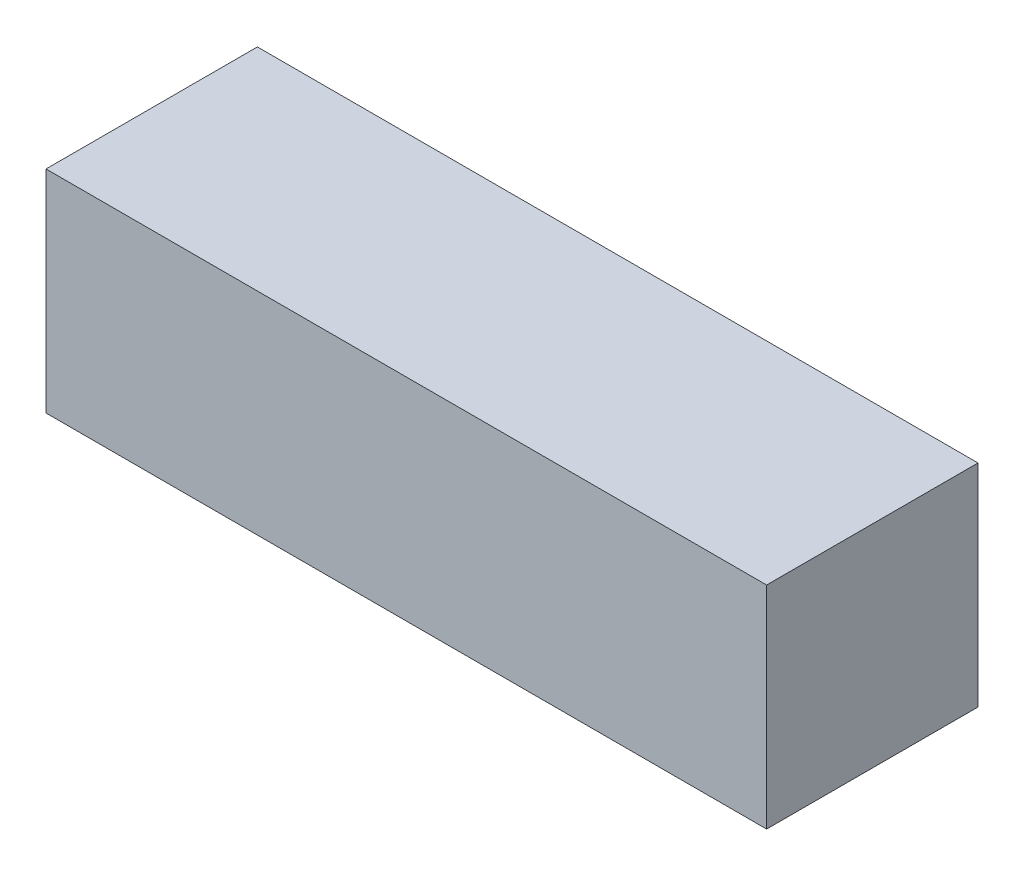
ISO-10303-21;
HEADER;
FILE_DESCRIPTION(('STEP AP214'),'2;1');
FILE_NAME('part.step','',(''),(''),'','','');
FILE_SCHEMA(('AUTOMOTIVE_DESIGN { 1 0 10303 214 1 1 1 1 }'));
ENDSEC;
DATA;
#1=APPLICATION_CONTEXT('core data for automotive mechanical design processes');
#2=APPLICATION_PROTOCOL_DEFINITION('international standard','automotive_design',2000,#1);
#3=PRODUCT_CONTEXT('',#1,'mechanical');
#4=PRODUCT('Part','Part','',(#3));
#5=PRODUCT_RELATED_PRODUCT_CATEGORY('part','',(#4));
#6=PRODUCT_DEFINITION_FORMATION('','',#4);
#7=PRODUCT_DEFINITION_CONTEXT('part definition',#1,'design');
#8=PRODUCT_DEFINITION('design','',#6,#7);
#9=PRODUCT_DEFINITION_SHAPE('','',#8);
#10=(LENGTH_UNIT() NAMED_UNIT(*) SI_UNIT(.MILLI.,.METRE.));
#11=(NAMED_UNIT(*) PLANE_ANGLE_UNIT() SI_UNIT($,.RADIAN.));
#12=(NAMED_UNIT(*) SI_UNIT($,.STERADIAN.) SOLID_ANGLE_UNIT());
#13=UNCERTAINTY_MEASURE_WITH_UNIT(LENGTH_MEASURE(1.E-05),#10,'distance_accuracy_value','');
#14=(GEOMETRIC_REPRESENTATION_CONTEXT(3) GLOBAL_UNCERTAINTY_ASSIGNED_CONTEXT((#13)) GLOBAL_UNIT_ASSIGNED_CONTEXT((#10,
#11,#12)) REPRESENTATION_CONTEXT('',''));
#15=CARTESIAN_POINT('',(0.,0.,0.));
#16=DIRECTION('',(0.,0.,1.));
#17=DIRECTION('',(1.,0.,0.));
#18=AXIS2_PLACEMENT_3D('',#15,#16,#17);
#19=CARTESIAN_POINT('',(0.,0.,0.));
#20=DIRECTION('',(0.,-1.,0.));
#21=DIRECTION('',(0.,0.,-1.));
#22=AXIS2_PLACEMENT_3D('',#19,#20,#21);
#23=PLANE('',#22);
#24=DIRECTION('',(0.,0.,1.));
#25=VECTOR('',#24,1.);
#26=CARTESIAN_POINT('',(0.,0.,0.));
#27=LINE('',#26,#25);
#28=CARTESIAN_POINT('',(0.,0.,-11.176));
#29=VERTEX_POINT('',#28);
#30=CARTESIAN_POINT('',(0.,0.,0.));
#31=VERTEX_POINT('',#30);
#32=EDGE_CURVE('E131',#29,#31,#27,.T.);
#33=ORIENTED_EDGE('',*,*,#32,.F.);
#34=DIRECTION('',(-1.,0.,0.));
#35=VECTOR('',#34,1.);
#36=CARTESIAN_POINT('',(0.,0.,-11.176));
#37=LINE('',#36,#35);
#38=CARTESIAN_POINT('',(38.1,0.,-11.176));
#39=VERTEX_POINT('',#38);
#40=EDGE_CURVE('E79',#39,#29,#37,.T.);
#41=ORIENTED_EDGE('',*,*,#40,.F.);
#42=DIRECTION('',(0.,0.,-1.));
#43=VECTOR('',#42,1.);
#44=CARTESIAN_POINT('',(38.1,0.,0.));
#45=LINE('',#44,#43);
#46=CARTESIAN_POINT('',(38.1,0.,0.));
#47=VERTEX_POINT('',#46);
#48=EDGE_CURVE('E159',#47,#39,#45,.T.);
#49=ORIENTED_EDGE('',*,*,#48,.F.);
#50=DIRECTION('',(1.,0.,0.));
#51=VECTOR('',#50,1.);
#52=CARTESIAN_POINT('',(0.,0.,0.));
#53=LINE('',#52,#51);
#54=EDGE_CURVE('E135',#31,#47,#53,.T.);
#55=ORIENTED_EDGE('',*,*,#54,.F.);
#56=EDGE_LOOP('',(#33,#41,#49,#55));
#57=FACE_BOUND('',#56,.T.);
#58=DIRECTION('',(-1.,0.,0.));
#59=VECTOR('',#58,1.);
#60=CARTESIAN_POINT('',(0.,0.,-8.89));
#61=LINE('',#60,#59);
#62=CARTESIAN_POINT('',(35.814,0.,-8.89));
#63=VERTEX_POINT('',#62);
#64=CARTESIAN_POINT('',(2.28600000000001,0.,-8.89));
#65=VERTEX_POINT('',#64);
#66=EDGE_CURVE('E126',#63,#65,#61,.T.);
#67=ORIENTED_EDGE('',*,*,#66,.T.);
#68=DIRECTION('',(0.,0.,1.));
#69=VECTOR('',#68,1.);
#70=CARTESIAN_POINT('',(2.286,0.,0.));
#71=LINE('',#70,#69);
#72=CARTESIAN_POINT('',(2.286,0.,-2.286));
#73=VERTEX_POINT('',#72);
#74=EDGE_CURVE('E145',#65,#73,#71,.T.);
#75=ORIENTED_EDGE('',*,*,#74,.T.);
#76=DIRECTION('',(1.,0.,0.));
#77=VECTOR('',#76,1.);
#78=CARTESIAN_POINT('',(0.,0.,-2.286));
#79=LINE('',#78,#77);
#80=CARTESIAN_POINT('',(35.814,0.,-2.286));
#81=VERTEX_POINT('',#80);
#82=EDGE_CURVE('E130',#73,#81,#79,.T.);
#83=ORIENTED_EDGE('',*,*,#82,.T.);
#84=DIRECTION('',(0.,0.,-1.));
#85=VECTOR('',#84,1.);
#86=CARTESIAN_POINT('',(35.814,0.,0.));
#87=LINE('',#86,#85);
#88=EDGE_CURVE('E49',#81,#63,#87,.T.);
#89=ORIENTED_EDGE('',*,*,#88,.T.);
#90=EDGE_LOOP('',(#67,#75,#83,#89));
#91=FACE_BOUND('',#90,.T.);
#92=ADVANCED_FACE('F34',(#57,#91),#23,.T.);
#93=CARTESIAN_POINT('',(0.,11.176,0.));
#94=DIRECTION('',(1.,0.,0.));
#95=DIRECTION('',(0.,0.,-1.));
#96=AXIS2_PLACEMENT_3D('',#93,#94,#95);
#97=PLANE('',#96);
#98=ORIENTED_EDGE('',*,*,#32,.T.);
#99=DIRECTION('',(0.,-1.,0.));
#100=VECTOR('',#99,1.);
#101=CARTESIAN_POINT('',(0.,11.176,0.));
#102=LINE('',#101,#100);
#103=CARTESIAN_POINT('',(0.,11.176,0.));
#104=VERTEX_POINT('',#103);
#105=EDGE_CURVE('E11',#104,#31,#102,.T.);
#106=ORIENTED_EDGE('',*,*,#105,.F.);
#107=DIRECTION('',(0.,0.,1.));
#108=VECTOR('',#107,1.);
#109=CARTESIAN_POINT('',(0.,11.176,0.));
#110=LINE('',#109,#108);
#111=CARTESIAN_POINT('',(0.,11.176,-11.176));
#112=VERTEX_POINT('',#111);
#113=EDGE_CURVE('E151',#112,#104,#110,.T.);
#114=ORIENTED_EDGE('',*,*,#113,.F.);
#115=DIRECTION('',(0.,-1.,0.));
#116=VECTOR('',#115,1.);
#117=CARTESIAN_POINT('',(0.,11.176,-11.176));
#118=LINE('',#117,#116);
#119=EDGE_CURVE('E156',#112,#29,#118,.T.);
#120=ORIENTED_EDGE('',*,*,#119,.T.);
#121=EDGE_LOOP('',(#98,#106,#114,#120));
#122=FACE_BOUND('',#121,.T.);
#123=ADVANCED_FACE('F36',(#122),#97,.F.);
#124=CARTESIAN_POINT('',(0.,11.176,0.));
#125=DIRECTION('',(0.,0.,-1.));
#126=DIRECTION('',(-1.,0.,0.));
#127=AXIS2_PLACEMENT_3D('',#124,#125,#126);
#128=PLANE('',#127);
#129=ORIENTED_EDGE('',*,*,#54,.T.);
#130=DIRECTION('',(0.,-1.,0.));
#131=VECTOR('',#130,1.);
#132=CARTESIAN_POINT('',(38.1,11.176,0.));
#133=LINE('',#132,#131);
#134=CARTESIAN_POINT('',(38.1,11.176,0.));
#135=VERTEX_POINT('',#134);
#136=EDGE_CURVE('E42',#135,#47,#133,.T.);
#137=ORIENTED_EDGE('',*,*,#136,.F.);
#138=DIRECTION('',(1.,0.,0.));
#139=VECTOR('',#138,1.);
#140=CARTESIAN_POINT('',(0.,11.176,0.));
#141=LINE('',#140,#139);
#142=EDGE_CURVE('E86',#104,#135,#141,.T.);
#143=ORIENTED_EDGE('',*,*,#142,.F.);
#144=ORIENTED_EDGE('',*,*,#105,.T.);
#145=EDGE_LOOP('',(#129,#137,#143,#144));
#146=FACE_BOUND('',#145,.T.);
#147=ADVANCED_FACE('F185',(#146),#128,.F.);
#148=CARTESIAN_POINT('',(38.1,11.176,0.));
#149=DIRECTION('',(-1.,0.,0.));
#150=DIRECTION('',(0.,0.,1.));
#151=AXIS2_PLACEMENT_3D('',#148,#149,#150);
#152=PLANE('',#151);
#153=ORIENTED_EDGE('',*,*,#48,.T.);
#154=DIRECTION('',(0.,-1.,0.));
#155=VECTOR('',#154,1.);
#156=CARTESIAN_POINT('',(38.1,11.176,-11.176));
#157=LINE('',#156,#155);
#158=CARTESIAN_POINT('',(38.1,11.176,-11.176));
#159=VERTEX_POINT('',#158);
#160=EDGE_CURVE('E163',#159,#39,#157,.T.);
#161=ORIENTED_EDGE('',*,*,#160,.F.);
#162=DIRECTION('',(0.,0.,-1.));
#163=VECTOR('',#162,1.);
#164=CARTESIAN_POINT('',(38.1,11.176,0.));
#165=LINE('',#164,#163);
#166=EDGE_CURVE('E154',#135,#159,#165,.T.);
#167=ORIENTED_EDGE('',*,*,#166,.F.);
#168=ORIENTED_EDGE('',*,*,#136,.T.);
#169=EDGE_LOOP('',(#153,#161,#167,#168));
#170=FACE_BOUND('',#169,.T.);
#171=ADVANCED_FACE('F168',(#170),#152,.F.);
#172=CARTESIAN_POINT('',(0.,11.176,-11.176));
#173=DIRECTION('',(0.,0.,1.));
#174=DIRECTION('',(1.,0.,0.));
#175=AXIS2_PLACEMENT_3D('',#172,#173,#174);
#176=PLANE('',#175);
#177=ORIENTED_EDGE('',*,*,#40,.T.);
#178=ORIENTED_EDGE('',*,*,#119,.F.);
#179=DIRECTION('',(-1.,0.,0.));
#180=VECTOR('',#179,1.);
#181=CARTESIAN_POINT('',(0.,11.176,-11.176));
#182=LINE('',#181,#180);
#183=EDGE_CURVE('E58',#159,#112,#182,.T.);
#184=ORIENTED_EDGE('',*,*,#183,.F.);
#185=ORIENTED_EDGE('',*,*,#160,.T.);
#186=EDGE_LOOP('',(#177,#178,#184,#185));
#187=FACE_BOUND('',#186,.T.);
#188=ADVANCED_FACE('F176',(#187),#176,.F.);
#189=CARTESIAN_POINT('',(0.,11.176,0.));
#190=DIRECTION('',(0.,-1.,0.));
#191=DIRECTION('',(0.,0.,-1.));
#192=AXIS2_PLACEMENT_3D('',#189,#190,#191);
#193=PLANE('',#192);
#194=ORIENTED_EDGE('',*,*,#113,.T.);
#195=ORIENTED_EDGE('',*,*,#142,.T.);
#196=ORIENTED_EDGE('',*,*,#166,.T.);
#197=ORIENTED_EDGE('',*,*,#183,.T.);
#198=EDGE_LOOP('',(#194,#195,#196,#197));
#199=FACE_BOUND('',#198,.T.);
#200=ADVANCED_FACE('F178',(#199),#193,.F.);
#201=CARTESIAN_POINT('',(2.286,11.176,0.));
#202=DIRECTION('',(1.,0.,0.));
#203=DIRECTION('',(0.,0.,-1.));
#204=AXIS2_PLACEMENT_3D('',#201,#202,#203);
#205=PLANE('',#204);
#206=ORIENTED_EDGE('',*,*,#74,.F.);
#207=DIRECTION('',(0.,-1.,0.));
#208=VECTOR('',#207,1.);
#209=CARTESIAN_POINT('',(2.28600000000001,11.176,-8.89));
#210=LINE('',#209,#208);
#211=CARTESIAN_POINT('',(2.28600000000001,8.89,-8.89));
#212=VERTEX_POINT('',#211);
#213=EDGE_CURVE('E125',#212,#65,#210,.T.);
#214=ORIENTED_EDGE('',*,*,#213,.F.);
#215=DIRECTION('',(0.,0.,1.));
#216=VECTOR('',#215,1.);
#217=CARTESIAN_POINT('',(2.286,8.89,0.));
#218=LINE('',#217,#216);
#219=CARTESIAN_POINT('',(2.286,8.89,-2.286));
#220=VERTEX_POINT('',#219);
#221=EDGE_CURVE('E113',#212,#220,#218,.T.);
#222=ORIENTED_EDGE('',*,*,#221,.T.);
#223=DIRECTION('',(0.,-1.,0.));
#224=VECTOR('',#223,1.);
#225=CARTESIAN_POINT('',(2.286,11.176,-2.286));
#226=LINE('',#225,#224);
#227=EDGE_CURVE('E123',#220,#73,#226,.T.);
#228=ORIENTED_EDGE('',*,*,#227,.T.);
#229=EDGE_LOOP('',(#206,#214,#222,#228));
#230=FACE_BOUND('',#229,.T.);
#231=ADVANCED_FACE('F122',(#230),#205,.T.);
#232=CARTESIAN_POINT('',(0.,11.176,-2.286));
#233=DIRECTION('',(0.,0.,-1.));
#234=DIRECTION('',(-1.,0.,0.));
#235=AXIS2_PLACEMENT_3D('',#232,#233,#234);
#236=PLANE('',#235);
#237=ORIENTED_EDGE('',*,*,#82,.F.);
#238=ORIENTED_EDGE('',*,*,#227,.F.);
#239=DIRECTION('',(1.,0.,0.));
#240=VECTOR('',#239,1.);
#241=CARTESIAN_POINT('',(0.,8.89,-2.286));
#242=LINE('',#241,#240);
#243=CARTESIAN_POINT('',(35.814,8.89,-2.286));
#244=VERTEX_POINT('',#243);
#245=EDGE_CURVE('E109',#220,#244,#242,.T.);
#246=ORIENTED_EDGE('',*,*,#245,.T.);
#247=DIRECTION('',(0.,-1.,0.));
#248=VECTOR('',#247,1.);
#249=CARTESIAN_POINT('',(35.814,11.176,-2.286));
#250=LINE('',#249,#248);
#251=EDGE_CURVE('E132',#244,#81,#250,.T.);
#252=ORIENTED_EDGE('',*,*,#251,.T.);
#253=EDGE_LOOP('',(#237,#238,#246,#252));
#254=FACE_BOUND('',#253,.T.);
#255=ADVANCED_FACE('F128',(#254),#236,.T.);
#256=CARTESIAN_POINT('',(35.814,11.176,0.));
#257=DIRECTION('',(-1.,0.,0.));
#258=DIRECTION('',(0.,0.,1.));
#259=AXIS2_PLACEMENT_3D('',#256,#257,#258);
#260=PLANE('',#259);
#261=ORIENTED_EDGE('',*,*,#88,.F.);
#262=ORIENTED_EDGE('',*,*,#251,.F.);
#263=DIRECTION('',(0.,0.,-1.));
#264=VECTOR('',#263,1.);
#265=CARTESIAN_POINT('',(35.814,8.89,0.));
#266=LINE('',#265,#264);
#267=CARTESIAN_POINT('',(35.814,8.89,-8.89));
#268=VERTEX_POINT('',#267);
#269=EDGE_CURVE('E114',#244,#268,#266,.T.);
#270=ORIENTED_EDGE('',*,*,#269,.T.);
#271=DIRECTION('',(0.,-1.,0.));
#272=VECTOR('',#271,1.);
#273=CARTESIAN_POINT('',(35.814,11.176,-8.89));
#274=LINE('',#273,#272);
#275=EDGE_CURVE('E137',#268,#63,#274,.T.);
#276=ORIENTED_EDGE('',*,*,#275,.T.);
#277=EDGE_LOOP('',(#261,#262,#270,#276));
#278=FACE_BOUND('',#277,.T.);
#279=ADVANCED_FACE('F200',(#278),#260,.T.);
#280=CARTESIAN_POINT('',(0.,11.176,-8.89));
#281=DIRECTION('',(0.,0.,1.));
#282=DIRECTION('',(1.,0.,0.));
#283=AXIS2_PLACEMENT_3D('',#280,#281,#282);
#284=PLANE('',#283);
#285=ORIENTED_EDGE('',*,*,#66,.F.);
#286=ORIENTED_EDGE('',*,*,#275,.F.);
#287=DIRECTION('',(-1.,0.,0.));
#288=VECTOR('',#287,1.);
#289=CARTESIAN_POINT('',(0.,8.89,-8.89));
#290=LINE('',#289,#288);
#291=EDGE_CURVE('E140',#268,#212,#290,.T.);
#292=ORIENTED_EDGE('',*,*,#291,.T.);
#293=ORIENTED_EDGE('',*,*,#213,.T.);
#294=EDGE_LOOP('',(#285,#286,#292,#293));
#295=FACE_BOUND('',#294,.T.);
#296=ADVANCED_FACE('F197',(#295),#284,.T.);
#297=CARTESIAN_POINT('',(0.,8.89,0.));
#298=DIRECTION('',(0.,-1.,0.));
#299=DIRECTION('',(0.,0.,-1.));
#300=AXIS2_PLACEMENT_3D('',#297,#298,#299);
#301=PLANE('',#300);
#302=ORIENTED_EDGE('',*,*,#221,.F.);
#303=ORIENTED_EDGE('',*,*,#291,.F.);
#304=ORIENTED_EDGE('',*,*,#269,.F.);
#305=ORIENTED_EDGE('',*,*,#245,.F.);
#306=EDGE_LOOP('',(#302,#303,#304,#305));
#307=FACE_BOUND('',#306,.T.);
#308=ADVANCED_FACE('F111',(#307),#301,.T.);
#309=CLOSED_SHELL('',(#92,#123,#147,#171,#188,#200,#231,#255,#279,#296,#308));
#310=MANIFOLD_SOLID_BREP('B2',#309);
#311=ADVANCED_BREP_SHAPE_REPRESENTATION('',(#18,#310),#14);
#312=SHAPE_DEFINITION_REPRESENTATION(#9,#311);
ENDSEC;
END-ISO-10303-21;
